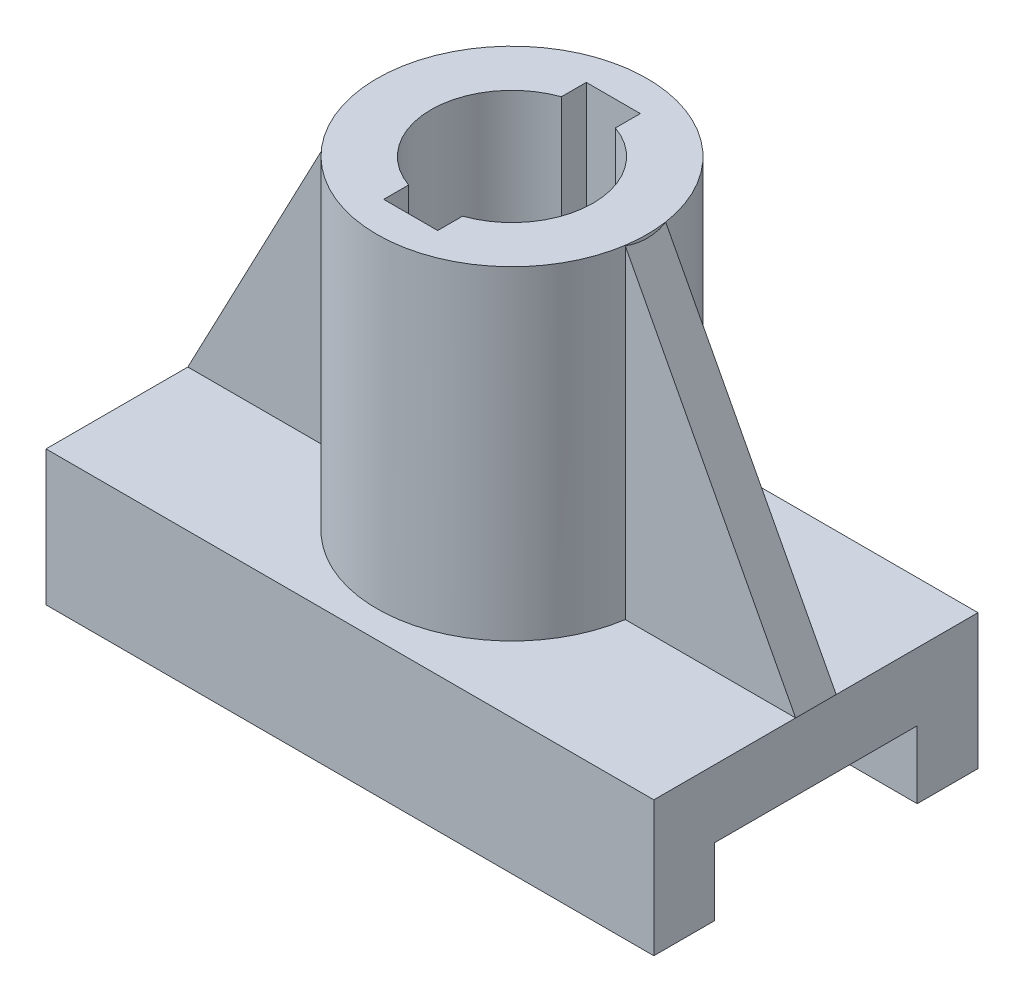
ISO-10303-21;
HEADER;
FILE_DESCRIPTION(('STEP AP214'),'2;1');
FILE_NAME('part.step','',(''),(''),'','','');
FILE_SCHEMA(('AUTOMOTIVE_DESIGN { 1 0 10303 214 1 1 1 1 }'));
ENDSEC;
DATA;
#1=APPLICATION_CONTEXT('core data for automotive mechanical design processes');
#2=APPLICATION_PROTOCOL_DEFINITION('international standard','automotive_design',2000,#1);
#3=PRODUCT_CONTEXT('',#1,'mechanical');
#4=PRODUCT('Part','Part','',(#3));
#5=PRODUCT_RELATED_PRODUCT_CATEGORY('part','',(#4));
#6=PRODUCT_DEFINITION_FORMATION('','',#4);
#7=PRODUCT_DEFINITION_CONTEXT('part definition',#1,'design');
#8=PRODUCT_DEFINITION('design','',#6,#7);
#9=PRODUCT_DEFINITION_SHAPE('','',#8);
#10=(LENGTH_UNIT() NAMED_UNIT(*) SI_UNIT(.MILLI.,.METRE.));
#11=(NAMED_UNIT(*) PLANE_ANGLE_UNIT() SI_UNIT($,.RADIAN.));
#12=(NAMED_UNIT(*) SI_UNIT($,.STERADIAN.) SOLID_ANGLE_UNIT());
#13=UNCERTAINTY_MEASURE_WITH_UNIT(LENGTH_MEASURE(1.E-05),#10,'distance_accuracy_value','');
#14=(GEOMETRIC_REPRESENTATION_CONTEXT(3) GLOBAL_UNCERTAINTY_ASSIGNED_CONTEXT((#13)) GLOBAL_UNIT_ASSIGNED_CONTEXT((#10,
#11,#12)) REPRESENTATION_CONTEXT('',''));
#15=CARTESIAN_POINT('',(0.,0.,0.));
#16=DIRECTION('',(0.,0.,1.));
#17=DIRECTION('',(1.,0.,0.));
#18=AXIS2_PLACEMENT_3D('',#15,#16,#17);
#19=CARTESIAN_POINT('',(0.,20.,0.));
#20=DIRECTION('',(0.,1.,0.));
#21=DIRECTION('',(0.,0.,1.));
#22=AXIS2_PLACEMENT_3D('',#19,#20,#21);
#23=PLANE('',#22);
#24=DIRECTION('',(0.,0.,1.));
#25=VECTOR('',#24,1.);
#26=CARTESIAN_POINT('',(-45.,20.,-24.));
#27=LINE('',#26,#25);
#28=CARTESIAN_POINT('',(-45.,20.,-24.));
#29=VERTEX_POINT('',#28);
#30=CARTESIAN_POINT('',(-45.,20.,-3.));
#31=VERTEX_POINT('',#30);
#32=EDGE_CURVE('E202',#29,#31,#27,.T.);
#33=ORIENTED_EDGE('',*,*,#32,.T.);
#34=DIRECTION('',(-1.,0.,0.));
#35=VECTOR('',#34,1.);
#36=CARTESIAN_POINT('',(0.,20.,-3.));
#37=LINE('',#36,#35);
#38=CARTESIAN_POINT('',(-19.7737199332852,20.,-3.));
#39=VERTEX_POINT('',#38);
#40=EDGE_CURVE('E201',#39,#31,#37,.T.);
#41=ORIENTED_EDGE('',*,*,#40,.F.);
#42=CARTESIAN_POINT('',(0.,20.,0.));
#43=DIRECTION('',(0.,1.,0.));
#44=DIRECTION('',(0.,0.,1.));
#45=AXIS2_PLACEMENT_3D('',#42,#43,#44);
#46=CIRCLE('',#45,20.);
#47=CARTESIAN_POINT('',(19.7737199332852,20.,-3.));
#48=VERTEX_POINT('',#47);
#49=EDGE_CURVE('E186',#48,#39,#46,.T.);
#50=ORIENTED_EDGE('',*,*,#49,.F.);
#51=DIRECTION('',(1.,0.,0.));
#52=VECTOR('',#51,1.);
#53=CARTESIAN_POINT('',(0.,20.,-3.));
#54=LINE('',#53,#52);
#55=CARTESIAN_POINT('',(45.,20.,-3.));
#56=VERTEX_POINT('',#55);
#57=EDGE_CURVE('E224',#48,#56,#54,.T.);
#58=ORIENTED_EDGE('',*,*,#57,.T.);
#59=DIRECTION('',(0.,0.,-1.));
#60=VECTOR('',#59,1.);
#61=CARTESIAN_POINT('',(45.,20.,-24.));
#62=LINE('',#61,#60);
#63=CARTESIAN_POINT('',(45.,20.,-24.));
#64=VERTEX_POINT('',#63);
#65=EDGE_CURVE('E316',#56,#64,#62,.T.);
#66=ORIENTED_EDGE('',*,*,#65,.T.);
#67=DIRECTION('',(-1.,0.,0.));
#68=VECTOR('',#67,1.);
#69=CARTESIAN_POINT('',(-45.,20.,-24.));
#70=LINE('',#69,#68);
#71=EDGE_CURVE('E315',#64,#29,#70,.T.);
#72=ORIENTED_EDGE('',*,*,#71,.T.);
#73=EDGE_LOOP('',(#33,#41,#50,#58,#66,#72));
#74=FACE_BOUND('',#73,.T.);
#75=ADVANCED_FACE('F37',(#74),#23,.T.);
#76=CARTESIAN_POINT('',(45.,20.,-24.));
#77=DIRECTION('',(-1.,0.,0.));
#78=DIRECTION('',(0.,0.,1.));
#79=AXIS2_PLACEMENT_3D('',#76,#77,#78);
#80=PLANE('',#79);
#81=DIRECTION('',(0.,0.,-1.));
#82=VECTOR('',#81,1.);
#83=CARTESIAN_POINT('',(45.,10.,-15.));
#84=LINE('',#83,#82);
#85=CARTESIAN_POINT('',(45.,10.,15.));
#86=VERTEX_POINT('',#85);
#87=CARTESIAN_POINT('',(45.,10.,-15.));
#88=VERTEX_POINT('',#87);
#89=EDGE_CURVE('E245',#86,#88,#84,.T.);
#90=ORIENTED_EDGE('',*,*,#89,.T.);
#91=DIRECTION('',(0.,-1.,0.));
#92=VECTOR('',#91,1.);
#93=CARTESIAN_POINT('',(45.,0.,-15.));
#94=LINE('',#93,#92);
#95=CARTESIAN_POINT('',(45.,0.,-15.));
#96=VERTEX_POINT('',#95);
#97=EDGE_CURVE('E239',#88,#96,#94,.T.);
#98=ORIENTED_EDGE('',*,*,#97,.T.);
#99=DIRECTION('',(0.,0.,-1.));
#100=VECTOR('',#99,1.);
#101=CARTESIAN_POINT('',(45.,0.,-24.));
#102=LINE('',#101,#100);
#103=CARTESIAN_POINT('',(45.,0.,-24.));
#104=VERTEX_POINT('',#103);
#105=EDGE_CURVE('E310',#96,#104,#102,.T.);
#106=ORIENTED_EDGE('',*,*,#105,.T.);
#107=DIRECTION('',(0.,-1.,0.));
#108=VECTOR('',#107,1.);
#109=CARTESIAN_POINT('',(45.,20.,-24.));
#110=LINE('',#109,#108);
#111=EDGE_CURVE('E342',#64,#104,#110,.T.);
#112=ORIENTED_EDGE('',*,*,#111,.F.);
#113=ORIENTED_EDGE('',*,*,#65,.F.);
#114=DIRECTION('',(0.,0.,1.));
#115=VECTOR('',#114,1.);
#116=CARTESIAN_POINT('',(45.,20.,0.));
#117=LINE('',#116,#115);
#118=CARTESIAN_POINT('',(45.,20.,3.));
#119=VERTEX_POINT('',#118);
#120=EDGE_CURVE('E236',#119,#56,#117,.F.);
#121=ORIENTED_EDGE('',*,*,#120,.F.);
#122=CARTESIAN_POINT('',(45.,20.,24.));
#123=VERTEX_POINT('',#122);
#124=EDGE_CURVE('E312',#123,#119,#62,.T.);
#125=ORIENTED_EDGE('',*,*,#124,.F.);
#126=DIRECTION('',(0.,-1.,0.));
#127=VECTOR('',#126,1.);
#128=CARTESIAN_POINT('',(45.,20.,24.));
#129=LINE('',#128,#127);
#130=CARTESIAN_POINT('',(45.,0.,24.));
#131=VERTEX_POINT('',#130);
#132=EDGE_CURVE('E322',#123,#131,#129,.T.);
#133=ORIENTED_EDGE('',*,*,#132,.T.);
#134=CARTESIAN_POINT('',(45.,0.,15.));
#135=VERTEX_POINT('',#134);
#136=EDGE_CURVE('E323',#131,#135,#102,.T.);
#137=ORIENTED_EDGE('',*,*,#136,.T.);
#138=DIRECTION('',(0.,1.,0.));
#139=VECTOR('',#138,1.);
#140=CARTESIAN_POINT('',(45.,0.,15.));
#141=LINE('',#140,#139);
#142=EDGE_CURVE('E242',#135,#86,#141,.T.);
#143=ORIENTED_EDGE('',*,*,#142,.T.);
#144=EDGE_LOOP('',(#90,#98,#106,#112,#113,#121,#125,#133,#137,#143));
#145=FACE_BOUND('',#144,.T.);
#146=ADVANCED_FACE('F39',(#145),#80,.F.);
#147=CARTESIAN_POINT('',(-45.,20.,-24.));
#148=DIRECTION('',(1.,0.,0.));
#149=DIRECTION('',(0.,0.,-1.));
#150=AXIS2_PLACEMENT_3D('',#147,#148,#149);
#151=PLANE('',#150);
#152=DIRECTION('',(0.,-1.,0.));
#153=VECTOR('',#152,1.);
#154=CARTESIAN_POINT('',(-45.,20.,24.));
#155=LINE('',#154,#153);
#156=CARTESIAN_POINT('',(-45.,20.,24.));
#157=VERTEX_POINT('',#156);
#158=CARTESIAN_POINT('',(-45.,0.,24.));
#159=VERTEX_POINT('',#158);
#160=EDGE_CURVE('E336',#157,#159,#155,.T.);
#161=ORIENTED_EDGE('',*,*,#160,.F.);
#162=CARTESIAN_POINT('',(-45.,20.,3.));
#163=VERTEX_POINT('',#162);
#164=EDGE_CURVE('E318',#163,#157,#27,.T.);
#165=ORIENTED_EDGE('',*,*,#164,.F.);
#166=DIRECTION('',(0.,0.,1.));
#167=VECTOR('',#166,1.);
#168=CARTESIAN_POINT('',(-45.,20.,0.));
#169=LINE('',#168,#167);
#170=EDGE_CURVE('E59',#163,#31,#169,.F.);
#171=ORIENTED_EDGE('',*,*,#170,.T.);
#172=ORIENTED_EDGE('',*,*,#32,.F.);
#173=DIRECTION('',(0.,-1.,0.));
#174=VECTOR('',#173,1.);
#175=CARTESIAN_POINT('',(-45.,20.,-24.));
#176=LINE('',#175,#174);
#177=CARTESIAN_POINT('',(-45.,0.,-24.));
#178=VERTEX_POINT('',#177);
#179=EDGE_CURVE('E339',#29,#178,#176,.T.);
#180=ORIENTED_EDGE('',*,*,#179,.T.);
#181=DIRECTION('',(0.,0.,1.));
#182=VECTOR('',#181,1.);
#183=CARTESIAN_POINT('',(-45.,0.,-24.));
#184=LINE('',#183,#182);
#185=CARTESIAN_POINT('',(-45.,0.,-15.));
#186=VERTEX_POINT('',#185);
#187=EDGE_CURVE('E329',#178,#186,#184,.T.);
#188=ORIENTED_EDGE('',*,*,#187,.T.);
#189=DIRECTION('',(0.,-1.,0.));
#190=VECTOR('',#189,1.);
#191=CARTESIAN_POINT('',(-45.,20.,-15.));
#192=LINE('',#191,#190);
#193=CARTESIAN_POINT('',(-45.,10.,-15.));
#194=VERTEX_POINT('',#193);
#195=EDGE_CURVE('E254',#194,#186,#192,.T.);
#196=ORIENTED_EDGE('',*,*,#195,.F.);
#197=DIRECTION('',(0.,0.,-1.));
#198=VECTOR('',#197,1.);
#199=CARTESIAN_POINT('',(-45.,10.,-24.));
#200=LINE('',#199,#198);
#201=CARTESIAN_POINT('',(-45.,10.,15.));
#202=VERTEX_POINT('',#201);
#203=EDGE_CURVE('E11',#202,#194,#200,.T.);
#204=ORIENTED_EDGE('',*,*,#203,.F.);
#205=DIRECTION('',(0.,1.,0.));
#206=VECTOR('',#205,1.);
#207=CARTESIAN_POINT('',(-45.,20.,15.));
#208=LINE('',#207,#206);
#209=CARTESIAN_POINT('',(-45.,0.,15.));
#210=VERTEX_POINT('',#209);
#211=EDGE_CURVE('E252',#210,#202,#208,.T.);
#212=ORIENTED_EDGE('',*,*,#211,.F.);
#213=EDGE_CURVE('E328',#210,#159,#184,.T.);
#214=ORIENTED_EDGE('',*,*,#213,.T.);
#215=EDGE_LOOP('',(#161,#165,#171,#172,#180,#188,#196,#204,#212,#214));
#216=FACE_BOUND('',#215,.T.);
#217=ADVANCED_FACE('F392',(#216),#151,.F.);
#218=CARTESIAN_POINT('',(0.,0.,0.));
#219=DIRECTION('',(0.,1.,0.));
#220=DIRECTION('',(0.,0.,1.));
#221=AXIS2_PLACEMENT_3D('',#218,#219,#220);
#222=PLANE('',#221);
#223=DIRECTION('',(1.,0.,0.));
#224=VECTOR('',#223,1.);
#225=CARTESIAN_POINT('',(0.,0.,-15.));
#226=LINE('',#225,#224);
#227=EDGE_CURVE('E45',#186,#96,#226,.T.);
#228=ORIENTED_EDGE('',*,*,#227,.F.);
#229=ORIENTED_EDGE('',*,*,#187,.F.);
#230=DIRECTION('',(-1.,0.,0.));
#231=VECTOR('',#230,1.);
#232=CARTESIAN_POINT('',(-45.,0.,-24.));
#233=LINE('',#232,#231);
#234=EDGE_CURVE('E326',#104,#178,#233,.T.);
#235=ORIENTED_EDGE('',*,*,#234,.F.);
#236=ORIENTED_EDGE('',*,*,#105,.F.);
#237=EDGE_LOOP('',(#228,#229,#235,#236));
#238=FACE_BOUND('',#237,.T.);
#239=ADVANCED_FACE('F358',(#238),#222,.F.);
#240=DIRECTION('',(-1.,0.,0.));
#241=VECTOR('',#240,1.);
#242=CARTESIAN_POINT('',(0.,0.,15.));
#243=LINE('',#242,#241);
#244=EDGE_CURVE('E197',#135,#210,#243,.T.);
#245=ORIENTED_EDGE('',*,*,#244,.F.);
#246=ORIENTED_EDGE('',*,*,#136,.F.);
#247=DIRECTION('',(1.,0.,0.));
#248=VECTOR('',#247,1.);
#249=CARTESIAN_POINT('',(-45.,0.,24.));
#250=LINE('',#249,#248);
#251=EDGE_CURVE('E332',#159,#131,#250,.T.);
#252=ORIENTED_EDGE('',*,*,#251,.F.);
#253=ORIENTED_EDGE('',*,*,#213,.F.);
#254=EDGE_LOOP('',(#245,#246,#252,#253));
#255=FACE_BOUND('',#254,.T.);
#256=ADVANCED_FACE('F413',(#255),#222,.F.);
#257=CARTESIAN_POINT('',(0.,20.,0.));
#258=DIRECTION('',(0.,1.,0.));
#259=DIRECTION('',(0.,0.,1.));
#260=AXIS2_PLACEMENT_3D('',#257,#258,#259);
#261=CYLINDRICAL_SURFACE('',#260,12.);
#262=CARTESIAN_POINT('',(0.,68.,0.));
#263=DIRECTION('',(0.,1.,0.));
#264=DIRECTION('',(0.,0.,1.));
#265=AXIS2_PLACEMENT_3D('',#262,#263,#264);
#266=CIRCLE('',#265,12.);
#267=CARTESIAN_POINT('',(4.,68.,11.3137084989848));
#268=VERTEX_POINT('',#267);
#269=CARTESIAN_POINT('',(4.,68.,-11.3137084989848));
#270=VERTEX_POINT('',#269);
#271=EDGE_CURVE('E307',#268,#270,#266,.T.);
#272=ORIENTED_EDGE('',*,*,#271,.T.);
#273=DIRECTION('',(0.,1.,0.));
#274=VECTOR('',#273,1.);
#275=CARTESIAN_POINT('',(4.,20.,-11.3137084989848));
#276=LINE('',#275,#274);
#277=CARTESIAN_POINT('',(4.,20.,-11.3137084989848));
#278=VERTEX_POINT('',#277);
#279=EDGE_CURVE('E299',#270,#278,#276,.F.);
#280=ORIENTED_EDGE('',*,*,#279,.T.);
#281=CARTESIAN_POINT('',(0.,20.,0.));
#282=DIRECTION('',(0.,1.,0.));
#283=DIRECTION('',(0.,0.,1.));
#284=AXIS2_PLACEMENT_3D('',#281,#282,#283);
#285=CIRCLE('',#284,12.);
#286=CARTESIAN_POINT('',(4.,20.,11.3137084989848));
#287=VERTEX_POINT('',#286);
#288=EDGE_CURVE('E303',#287,#278,#285,.T.);
#289=ORIENTED_EDGE('',*,*,#288,.F.);
#290=DIRECTION('',(0.,1.,0.));
#291=VECTOR('',#290,1.);
#292=CARTESIAN_POINT('',(4.,20.,11.3137084989848));
#293=LINE('',#292,#291);
#294=EDGE_CURVE('E296',#287,#268,#293,.T.);
#295=ORIENTED_EDGE('',*,*,#294,.T.);
#296=EDGE_LOOP('',(#272,#280,#289,#295));
#297=FACE_BOUND('',#296,.T.);
#298=ADVANCED_FACE('F407',(#297),#261,.F.);
#299=CARTESIAN_POINT('',(-45.,20.,-24.));
#300=DIRECTION('',(0.,0.,1.));
#301=DIRECTION('',(1.,0.,0.));
#302=AXIS2_PLACEMENT_3D('',#299,#300,#301);
#303=PLANE('',#302);
#304=ORIENTED_EDGE('',*,*,#234,.T.);
#305=ORIENTED_EDGE('',*,*,#179,.F.);
#306=ORIENTED_EDGE('',*,*,#71,.F.);
#307=ORIENTED_EDGE('',*,*,#111,.T.);
#308=EDGE_LOOP('',(#304,#305,#306,#307));
#309=FACE_BOUND('',#308,.T.);
#310=ADVANCED_FACE('F362',(#309),#303,.F.);
#311=CARTESIAN_POINT('',(-45.,20.,24.));
#312=DIRECTION('',(0.,0.,-1.));
#313=DIRECTION('',(-1.,0.,0.));
#314=AXIS2_PLACEMENT_3D('',#311,#312,#313);
#315=PLANE('',#314);
#316=ORIENTED_EDGE('',*,*,#251,.T.);
#317=ORIENTED_EDGE('',*,*,#132,.F.);
#318=DIRECTION('',(1.,0.,0.));
#319=VECTOR('',#318,1.);
#320=CARTESIAN_POINT('',(-45.,20.,24.));
#321=LINE('',#320,#319);
#322=EDGE_CURVE('E320',#157,#123,#321,.T.);
#323=ORIENTED_EDGE('',*,*,#322,.F.);
#324=ORIENTED_EDGE('',*,*,#160,.T.);
#325=EDGE_LOOP('',(#316,#317,#323,#324));
#326=FACE_BOUND('',#325,.T.);
#327=ADVANCED_FACE('F396',(#326),#315,.F.);
#328=DIRECTION('',(-1.,0.,0.));
#329=VECTOR('',#328,1.);
#330=CARTESIAN_POINT('',(0.,20.,3.));
#331=LINE('',#330,#329);
#332=CARTESIAN_POINT('',(-19.7737199332852,20.,3.));
#333=VERTEX_POINT('',#332);
#334=EDGE_CURVE('E52',#333,#163,#331,.T.);
#335=ORIENTED_EDGE('',*,*,#334,.T.);
#336=ORIENTED_EDGE('',*,*,#164,.T.);
#337=ORIENTED_EDGE('',*,*,#322,.T.);
#338=ORIENTED_EDGE('',*,*,#124,.T.);
#339=DIRECTION('',(1.,0.,0.));
#340=VECTOR('',#339,1.);
#341=CARTESIAN_POINT('',(0.,20.,3.));
#342=LINE('',#341,#340);
#343=CARTESIAN_POINT('',(19.7737199332852,20.,3.));
#344=VERTEX_POINT('',#343);
#345=EDGE_CURVE('E229',#344,#119,#342,.T.);
#346=ORIENTED_EDGE('',*,*,#345,.F.);
#347=EDGE_CURVE('E198',#333,#344,#46,.T.);
#348=ORIENTED_EDGE('',*,*,#347,.F.);
#349=EDGE_LOOP('',(#335,#336,#337,#338,#346,#348));
#350=FACE_BOUND('',#349,.T.);
#351=ADVANCED_FACE('F388',(#350),#23,.T.);
#352=CARTESIAN_POINT('',(0.,68.,0.));
#353=DIRECTION('',(0.,-1.,0.));
#354=DIRECTION('',(0.,0.,-1.));
#355=AXIS2_PLACEMENT_3D('',#352,#353,#354);
#356=CYLINDRICAL_SURFACE('',#355,20.);
#357=CARTESIAN_POINT('',(0.,105.5,0.));
#358=DIRECTION('',(-0.884918222381983,0.465746432832622,0.));
#359=DIRECTION('',(-0.465746432832622,-0.884918222381983,0.));
#360=AXIS2_PLACEMENT_3D('',#357,#358,#359);
#361=ELLIPSE('',#360,42.9418211071678,20.);
#362=CARTESIAN_POINT('',(-19.7737199332852,67.9299321267581,3.));
#363=VERTEX_POINT('',#362);
#364=CARTESIAN_POINT('',(-19.7737199332852,67.9299321267581,-3.));
#365=VERTEX_POINT('',#364);
#366=EDGE_CURVE('E217',#363,#365,#361,.F.);
#367=ORIENTED_EDGE('',*,*,#366,.F.);
#368=DIRECTION('',(0.,-1.,0.));
#369=VECTOR('',#368,1.);
#370=CARTESIAN_POINT('',(-19.7737199332852,68.,3.));
#371=LINE('',#370,#369);
#372=EDGE_CURVE('E211',#333,#363,#371,.F.);
#373=ORIENTED_EDGE('',*,*,#372,.F.);
#374=ORIENTED_EDGE('',*,*,#347,.T.);
#375=DIRECTION('',(0.,-1.,0.));
#376=VECTOR('',#375,1.);
#377=CARTESIAN_POINT('',(19.7737199332852,68.,3.));
#378=LINE('',#377,#376);
#379=CARTESIAN_POINT('',(19.7737199332852,67.9299321267581,3.));
#380=VERTEX_POINT('',#379);
#381=EDGE_CURVE('E232',#344,#380,#378,.F.);
#382=ORIENTED_EDGE('',*,*,#381,.T.);
#383=CARTESIAN_POINT('',(0.,105.5,0.));
#384=DIRECTION('',(-0.884918222381983,-0.465746432832622,0.));
#385=DIRECTION('',(0.465746432832622,-0.884918222381983,0.));
#386=AXIS2_PLACEMENT_3D('',#383,#384,#385);
#387=ELLIPSE('',#386,42.9418211071678,20.);
#388=CARTESIAN_POINT('',(19.7737199332852,67.9299321267581,-3.));
#389=VERTEX_POINT('',#388);
#390=EDGE_CURVE('E234',#380,#389,#387,.F.);
#391=ORIENTED_EDGE('',*,*,#390,.T.);
#392=DIRECTION('',(0.,-1.,0.));
#393=VECTOR('',#392,1.);
#394=CARTESIAN_POINT('',(19.7737199332852,68.,-3.));
#395=LINE('',#394,#393);
#396=EDGE_CURVE('E194',#48,#389,#395,.F.);
#397=ORIENTED_EDGE('',*,*,#396,.F.);
#398=ORIENTED_EDGE('',*,*,#49,.T.);
#399=DIRECTION('',(0.,-1.,0.));
#400=VECTOR('',#399,1.);
#401=CARTESIAN_POINT('',(-19.7737199332852,68.,-3.));
#402=LINE('',#401,#400);
#403=EDGE_CURVE('E191',#39,#365,#402,.F.);
#404=ORIENTED_EDGE('',*,*,#403,.T.);
#405=EDGE_LOOP('',(#367,#373,#374,#382,#391,#397,#398,#404));
#406=FACE_BOUND('',#405,.T.);
#407=CARTESIAN_POINT('',(0.,68.,0.));
#408=DIRECTION('',(0.,1.,0.));
#409=DIRECTION('',(0.,0.,1.));
#410=AXIS2_PLACEMENT_3D('',#407,#408,#409);
#411=CIRCLE('',#410,20.);
#412=CARTESIAN_POINT('',(0.,68.,20.));
#413=VERTEX_POINT('',#412);
#414=EDGE_CURVE('E305',#413,#413,#411,.T.);
#415=ORIENTED_EDGE('',*,*,#414,.F.);
#416=EDGE_LOOP('',(#415));
#417=FACE_BOUND('',#416,.T.);
#418=ADVANCED_FACE('F188',(#406,#417),#356,.T.);
#419=CARTESIAN_POINT('',(0.,68.,0.));
#420=DIRECTION('',(0.,1.,0.));
#421=DIRECTION('',(0.,0.,1.));
#422=AXIS2_PLACEMENT_3D('',#419,#420,#421);
#423=PLANE('',#422);
#424=DIRECTION('',(0.,0.,1.));
#425=VECTOR('',#424,1.);
#426=CARTESIAN_POINT('',(-4.,68.,15.));
#427=LINE('',#426,#425);
#428=CARTESIAN_POINT('',(-4.,68.,11.3137084989848));
#429=VERTEX_POINT('',#428);
#430=CARTESIAN_POINT('',(-4.,68.,15.));
#431=VERTEX_POINT('',#430);
#432=EDGE_CURVE('E275',#429,#431,#427,.T.);
#433=ORIENTED_EDGE('',*,*,#432,.F.);
#434=CARTESIAN_POINT('',(-4.,68.,-11.3137084989848));
#435=VERTEX_POINT('',#434);
#436=EDGE_CURVE('E302',#435,#429,#266,.T.);
#437=ORIENTED_EDGE('',*,*,#436,.F.);
#438=CARTESIAN_POINT('',(-4.,68.,-15.));
#439=VERTEX_POINT('',#438);
#440=EDGE_CURVE('E276',#439,#435,#427,.T.);
#441=ORIENTED_EDGE('',*,*,#440,.F.);
#442=DIRECTION('',(-1.,0.,0.));
#443=VECTOR('',#442,1.);
#444=CARTESIAN_POINT('',(-4.,68.,-15.));
#445=LINE('',#444,#443);
#446=CARTESIAN_POINT('',(4.,68.,-15.));
#447=VERTEX_POINT('',#446);
#448=EDGE_CURVE('E272',#447,#439,#445,.T.);
#449=ORIENTED_EDGE('',*,*,#448,.F.);
#450=DIRECTION('',(0.,0.,-1.));
#451=VECTOR('',#450,1.);
#452=CARTESIAN_POINT('',(4.,68.,15.));
#453=LINE('',#452,#451);
#454=EDGE_CURVE('E256',#270,#447,#453,.T.);
#455=ORIENTED_EDGE('',*,*,#454,.F.);
#456=ORIENTED_EDGE('',*,*,#271,.F.);
#457=CARTESIAN_POINT('',(4.,68.,15.));
#458=VERTEX_POINT('',#457);
#459=EDGE_CURVE('E270',#458,#268,#453,.T.);
#460=ORIENTED_EDGE('',*,*,#459,.F.);
#461=DIRECTION('',(1.,0.,0.));
#462=VECTOR('',#461,1.);
#463=CARTESIAN_POINT('',(-4.,68.,15.));
#464=LINE('',#463,#462);
#465=EDGE_CURVE('E278',#431,#458,#464,.T.);
#466=ORIENTED_EDGE('',*,*,#465,.F.);
#467=EDGE_LOOP('',(#433,#437,#441,#449,#455,#456,#460,#466));
#468=FACE_BOUND('',#467,.T.);
#469=ORIENTED_EDGE('',*,*,#414,.T.);
#470=EDGE_LOOP('',(#469));
#471=FACE_BOUND('',#470,.T.);
#472=ADVANCED_FACE('F401',(#468,#471),#423,.T.);
#473=DIRECTION('',(0.,1.,0.));
#474=VECTOR('',#473,1.);
#475=CARTESIAN_POINT('',(-4.,20.,11.3137084989848));
#476=LINE('',#475,#474);
#477=CARTESIAN_POINT('',(-4.,20.,11.3137084989848));
#478=VERTEX_POINT('',#477);
#479=EDGE_CURVE('E293',#429,#478,#476,.F.);
#480=ORIENTED_EDGE('',*,*,#479,.T.);
#481=CARTESIAN_POINT('',(-4.,20.,-11.3137084989848));
#482=VERTEX_POINT('',#481);
#483=EDGE_CURVE('E306',#482,#478,#285,.T.);
#484=ORIENTED_EDGE('',*,*,#483,.F.);
#485=DIRECTION('',(0.,1.,0.));
#486=VECTOR('',#485,1.);
#487=CARTESIAN_POINT('',(-4.,20.,-11.3137084989848));
#488=LINE('',#487,#486);
#489=EDGE_CURVE('E283',#482,#435,#488,.T.);
#490=ORIENTED_EDGE('',*,*,#489,.T.);
#491=ORIENTED_EDGE('',*,*,#436,.T.);
#492=EDGE_LOOP('',(#480,#484,#490,#491));
#493=FACE_BOUND('',#492,.T.);
#494=ADVANCED_FACE('F551',(#493),#261,.F.);
#495=CARTESIAN_POINT('',(0.,20.,0.));
#496=DIRECTION('',(0.,1.,0.));
#497=DIRECTION('',(0.,0.,1.));
#498=AXIS2_PLACEMENT_3D('',#495,#496,#497);
#499=PLANE('',#498);
#500=ORIENTED_EDGE('',*,*,#288,.T.);
#501=DIRECTION('',(0.,0.,-1.));
#502=VECTOR('',#501,1.);
#503=CARTESIAN_POINT('',(4.,20.,15.));
#504=LINE('',#503,#502);
#505=CARTESIAN_POINT('',(4.,20.,-15.));
#506=VERTEX_POINT('',#505);
#507=EDGE_CURVE('E260',#278,#506,#504,.T.);
#508=ORIENTED_EDGE('',*,*,#507,.T.);
#509=DIRECTION('',(-1.,0.,0.));
#510=VECTOR('',#509,1.);
#511=CARTESIAN_POINT('',(-4.,20.,-15.));
#512=LINE('',#511,#510);
#513=CARTESIAN_POINT('',(-4.,20.,-15.));
#514=VERTEX_POINT('',#513);
#515=EDGE_CURVE('E259',#506,#514,#512,.T.);
#516=ORIENTED_EDGE('',*,*,#515,.T.);
#517=DIRECTION('',(0.,0.,1.));
#518=VECTOR('',#517,1.);
#519=CARTESIAN_POINT('',(-4.,20.,15.));
#520=LINE('',#519,#518);
#521=EDGE_CURVE('E264',#514,#482,#520,.T.);
#522=ORIENTED_EDGE('',*,*,#521,.T.);
#523=ORIENTED_EDGE('',*,*,#483,.T.);
#524=CARTESIAN_POINT('',(-4.,20.,15.));
#525=VERTEX_POINT('',#524);
#526=EDGE_CURVE('E263',#478,#525,#520,.T.);
#527=ORIENTED_EDGE('',*,*,#526,.T.);
#528=DIRECTION('',(1.,0.,0.));
#529=VECTOR('',#528,1.);
#530=CARTESIAN_POINT('',(-4.,20.,15.));
#531=LINE('',#530,#529);
#532=CARTESIAN_POINT('',(4.,20.,15.));
#533=VERTEX_POINT('',#532);
#534=EDGE_CURVE('E266',#525,#533,#531,.T.);
#535=ORIENTED_EDGE('',*,*,#534,.T.);
#536=EDGE_CURVE('E257',#533,#287,#504,.T.);
#537=ORIENTED_EDGE('',*,*,#536,.T.);
#538=EDGE_LOOP('',(#500,#508,#516,#522,#523,#527,#535,#537));
#539=FACE_BOUND('',#538,.T.);
#540=ADVANCED_FACE('F511',(#539),#499,.T.);
#541=CARTESIAN_POINT('',(-4.,20.,15.));
#542=DIRECTION('',(-1.,0.,0.));
#543=DIRECTION('',(0.,0.,1.));
#544=AXIS2_PLACEMENT_3D('',#541,#542,#543);
#545=PLANE('',#544);
#546=ORIENTED_EDGE('',*,*,#521,.F.);
#547=DIRECTION('',(0.,1.,0.));
#548=VECTOR('',#547,1.);
#549=CARTESIAN_POINT('',(-4.,20.,-15.));
#550=LINE('',#549,#548);
#551=EDGE_CURVE('E287',#514,#439,#550,.T.);
#552=ORIENTED_EDGE('',*,*,#551,.T.);
#553=ORIENTED_EDGE('',*,*,#440,.T.);
#554=ORIENTED_EDGE('',*,*,#489,.F.);
#555=EDGE_LOOP('',(#546,#552,#553,#554));
#556=FACE_BOUND('',#555,.T.);
#557=ADVANCED_FACE('F506',(#556),#545,.F.);
#558=CARTESIAN_POINT('',(4.,20.,15.));
#559=DIRECTION('',(1.,0.,0.));
#560=DIRECTION('',(0.,0.,-1.));
#561=AXIS2_PLACEMENT_3D('',#558,#559,#560);
#562=PLANE('',#561);
#563=ORIENTED_EDGE('',*,*,#454,.T.);
#564=DIRECTION('',(0.,1.,0.));
#565=VECTOR('',#564,1.);
#566=CARTESIAN_POINT('',(4.,20.,-15.));
#567=LINE('',#566,#565);
#568=EDGE_CURVE('E269',#506,#447,#567,.T.);
#569=ORIENTED_EDGE('',*,*,#568,.F.);
#570=ORIENTED_EDGE('',*,*,#507,.F.);
#571=ORIENTED_EDGE('',*,*,#279,.F.);
#572=EDGE_LOOP('',(#563,#569,#570,#571));
#573=FACE_BOUND('',#572,.T.);
#574=ADVANCED_FACE('F510',(#573),#562,.F.);
#575=CARTESIAN_POINT('',(-4.,20.,-15.));
#576=DIRECTION('',(0.,0.,-1.));
#577=DIRECTION('',(-1.,0.,0.));
#578=AXIS2_PLACEMENT_3D('',#575,#576,#577);
#579=PLANE('',#578);
#580=ORIENTED_EDGE('',*,*,#448,.T.);
#581=ORIENTED_EDGE('',*,*,#551,.F.);
#582=ORIENTED_EDGE('',*,*,#515,.F.);
#583=ORIENTED_EDGE('',*,*,#568,.T.);
#584=EDGE_LOOP('',(#580,#581,#582,#583));
#585=FACE_BOUND('',#584,.T.);
#586=ADVANCED_FACE('F520',(#585),#579,.F.);
#587=ORIENTED_EDGE('',*,*,#536,.F.);
#588=DIRECTION('',(0.,1.,0.));
#589=VECTOR('',#588,1.);
#590=CARTESIAN_POINT('',(4.,20.,15.));
#591=LINE('',#590,#589);
#592=EDGE_CURVE('E281',#533,#458,#591,.T.);
#593=ORIENTED_EDGE('',*,*,#592,.T.);
#594=ORIENTED_EDGE('',*,*,#459,.T.);
#595=ORIENTED_EDGE('',*,*,#294,.F.);
#596=EDGE_LOOP('',(#587,#593,#594,#595));
#597=FACE_BOUND('',#596,.T.);
#598=ADVANCED_FACE('F523',(#597),#562,.F.);
#599=ORIENTED_EDGE('',*,*,#432,.T.);
#600=DIRECTION('',(0.,1.,0.));
#601=VECTOR('',#600,1.);
#602=CARTESIAN_POINT('',(-4.,20.,15.));
#603=LINE('',#602,#601);
#604=EDGE_CURVE('E284',#525,#431,#603,.T.);
#605=ORIENTED_EDGE('',*,*,#604,.F.);
#606=ORIENTED_EDGE('',*,*,#526,.F.);
#607=ORIENTED_EDGE('',*,*,#479,.F.);
#608=EDGE_LOOP('',(#599,#605,#606,#607));
#609=FACE_BOUND('',#608,.T.);
#610=ADVANCED_FACE('F500',(#609),#545,.F.);
#611=CARTESIAN_POINT('',(-4.,20.,15.));
#612=DIRECTION('',(0.,0.,1.));
#613=DIRECTION('',(1.,0.,0.));
#614=AXIS2_PLACEMENT_3D('',#611,#612,#613);
#615=PLANE('',#614);
#616=ORIENTED_EDGE('',*,*,#465,.T.);
#617=ORIENTED_EDGE('',*,*,#592,.F.);
#618=ORIENTED_EDGE('',*,*,#534,.F.);
#619=ORIENTED_EDGE('',*,*,#604,.T.);
#620=EDGE_LOOP('',(#616,#617,#618,#619));
#621=FACE_BOUND('',#620,.T.);
#622=ADVANCED_FACE('F475',(#621),#615,.F.);
#623=CARTESIAN_POINT('',(-45.000012,10.,-15.));
#624=DIRECTION('',(0.,-1.,0.));
#625=DIRECTION('',(0.,0.,-1.));
#626=AXIS2_PLACEMENT_3D('',#623,#624,#625);
#627=PLANE('',#626);
#628=ORIENTED_EDGE('',*,*,#203,.T.);
#629=DIRECTION('',(1.,0.,0.));
#630=VECTOR('',#629,1.);
#631=CARTESIAN_POINT('',(-45.000012,10.,-15.));
#632=LINE('',#631,#630);
#633=EDGE_CURVE('E247',#194,#88,#632,.T.);
#634=ORIENTED_EDGE('',*,*,#633,.T.);
#635=ORIENTED_EDGE('',*,*,#89,.F.);
#636=DIRECTION('',(1.,0.,0.));
#637=VECTOR('',#636,1.);
#638=CARTESIAN_POINT('',(-45.000012,10.,15.));
#639=LINE('',#638,#637);
#640=EDGE_CURVE('E250',#202,#86,#639,.T.);
#641=ORIENTED_EDGE('',*,*,#640,.F.);
#642=EDGE_LOOP('',(#628,#634,#635,#641));
#643=FACE_BOUND('',#642,.T.);
#644=ADVANCED_FACE('F471',(#643),#627,.T.);
#645=CARTESIAN_POINT('',(-45.000012,0.,-15.));
#646=DIRECTION('',(0.,0.,1.));
#647=DIRECTION('',(1.,0.,0.));
#648=AXIS2_PLACEMENT_3D('',#645,#646,#647);
#649=PLANE('',#648);
#650=ORIENTED_EDGE('',*,*,#195,.T.);
#651=ORIENTED_EDGE('',*,*,#227,.T.);
#652=ORIENTED_EDGE('',*,*,#97,.F.);
#653=ORIENTED_EDGE('',*,*,#633,.F.);
#654=EDGE_LOOP('',(#650,#651,#652,#653));
#655=FACE_BOUND('',#654,.T.);
#656=ADVANCED_FACE('F348',(#655),#649,.T.);
#657=CARTESIAN_POINT('',(-45.000012,0.,15.));
#658=DIRECTION('',(0.,0.,-1.));
#659=DIRECTION('',(-1.,0.,0.));
#660=AXIS2_PLACEMENT_3D('',#657,#658,#659);
#661=PLANE('',#660);
#662=ORIENTED_EDGE('',*,*,#211,.T.);
#663=ORIENTED_EDGE('',*,*,#640,.T.);
#664=ORIENTED_EDGE('',*,*,#142,.F.);
#665=ORIENTED_EDGE('',*,*,#244,.T.);
#666=EDGE_LOOP('',(#662,#663,#664,#665));
#667=FACE_BOUND('',#666,.T.);
#668=ADVANCED_FACE('F481',(#667),#661,.T.);
#669=CARTESIAN_POINT('',(20.,67.5,0.));
#670=DIRECTION('',(-0.884918222381983,-0.465746432832622,0.));
#671=DIRECTION('',(0.465746432832622,-0.884918222381983,0.));
#672=AXIS2_PLACEMENT_3D('',#669,#670,#671);
#673=PLANE('',#672);
#674=DIRECTION('',(0.465746432832622,-0.884918222381983,0.));
#675=VECTOR('',#674,1.);
#676=CARTESIAN_POINT('',(20.,67.5,3.));
#677=LINE('',#676,#675);
#678=EDGE_CURVE('E221',#380,#119,#677,.T.);
#679=ORIENTED_EDGE('',*,*,#678,.T.);
#680=ORIENTED_EDGE('',*,*,#120,.T.);
#681=DIRECTION('',(0.465746432832622,-0.884918222381983,0.));
#682=VECTOR('',#681,1.);
#683=CARTESIAN_POINT('',(20.,67.5,-3.));
#684=LINE('',#683,#682);
#685=EDGE_CURVE('E220',#389,#56,#684,.T.);
#686=ORIENTED_EDGE('',*,*,#685,.F.);
#687=ORIENTED_EDGE('',*,*,#390,.F.);
#688=EDGE_LOOP('',(#679,#680,#686,#687));
#689=FACE_BOUND('',#688,.T.);
#690=ADVANCED_FACE('F367',(#689),#673,.F.);
#691=CARTESIAN_POINT('',(0.,34.,3.));
#692=DIRECTION('',(0.,0.,1.));
#693=DIRECTION('',(1.,0.,0.));
#694=AXIS2_PLACEMENT_3D('',#691,#692,#693);
#695=PLANE('',#694);
#696=ORIENTED_EDGE('',*,*,#381,.F.);
#697=ORIENTED_EDGE('',*,*,#345,.T.);
#698=ORIENTED_EDGE('',*,*,#678,.F.);
#699=EDGE_LOOP('',(#696,#697,#698));
#700=FACE_BOUND('',#699,.T.);
#701=ADVANCED_FACE('F374',(#700),#695,.T.);
#702=CARTESIAN_POINT('',(0.,34.,-3.));
#703=DIRECTION('',(0.,0.,1.));
#704=DIRECTION('',(1.,0.,0.));
#705=AXIS2_PLACEMENT_3D('',#702,#703,#704);
#706=PLANE('',#705);
#707=ORIENTED_EDGE('',*,*,#57,.F.);
#708=ORIENTED_EDGE('',*,*,#396,.T.);
#709=ORIENTED_EDGE('',*,*,#685,.T.);
#710=EDGE_LOOP('',(#707,#708,#709));
#711=FACE_BOUND('',#710,.T.);
#712=ADVANCED_FACE('F371',(#711),#706,.F.);
#713=CARTESIAN_POINT('',(-20.,67.5,0.));
#714=DIRECTION('',(0.884918222381983,-0.465746432832622,0.));
#715=DIRECTION('',(-0.465746432832622,-0.884918222381983,0.));
#716=AXIS2_PLACEMENT_3D('',#713,#714,#715);
#717=PLANE('',#716);
#718=DIRECTION('',(-0.465746432832622,-0.884918222381983,0.));
#719=VECTOR('',#718,1.);
#720=CARTESIAN_POINT('',(-20.,67.5,3.));
#721=LINE('',#720,#719);
#722=EDGE_CURVE('E205',#363,#163,#721,.T.);
#723=ORIENTED_EDGE('',*,*,#722,.F.);
#724=ORIENTED_EDGE('',*,*,#366,.T.);
#725=DIRECTION('',(-0.465746432832622,-0.884918222381983,0.));
#726=VECTOR('',#725,1.);
#727=CARTESIAN_POINT('',(-20.,67.5,-3.));
#728=LINE('',#727,#726);
#729=EDGE_CURVE('E208',#365,#31,#728,.T.);
#730=ORIENTED_EDGE('',*,*,#729,.T.);
#731=ORIENTED_EDGE('',*,*,#170,.F.);
#732=EDGE_LOOP('',(#723,#724,#730,#731));
#733=FACE_BOUND('',#732,.T.);
#734=ADVANCED_FACE('F373',(#733),#717,.F.);
#735=CARTESIAN_POINT('',(0.,34.,3.));
#736=DIRECTION('',(0.,0.,1.));
#737=DIRECTION('',(-1.,0.,0.));
#738=AXIS2_PLACEMENT_3D('',#735,#736,#737);
#739=PLANE('',#738);
#740=ORIENTED_EDGE('',*,*,#372,.T.);
#741=ORIENTED_EDGE('',*,*,#722,.T.);
#742=ORIENTED_EDGE('',*,*,#334,.F.);
#743=EDGE_LOOP('',(#740,#741,#742));
#744=FACE_BOUND('',#743,.T.);
#745=ADVANCED_FACE('F380',(#744),#739,.T.);
#746=CARTESIAN_POINT('',(0.,34.,-3.));
#747=DIRECTION('',(0.,0.,1.));
#748=DIRECTION('',(-1.,0.,0.));
#749=AXIS2_PLACEMENT_3D('',#746,#747,#748);
#750=PLANE('',#749);
#751=ORIENTED_EDGE('',*,*,#40,.T.);
#752=ORIENTED_EDGE('',*,*,#729,.F.);
#753=ORIENTED_EDGE('',*,*,#403,.F.);
#754=EDGE_LOOP('',(#751,#752,#753));
#755=FACE_BOUND('',#754,.T.);
#756=ADVANCED_FACE('F207',(#755),#750,.F.);
#757=CLOSED_SHELL('',(#75,#146,#217,#239,#256,#298,#310,#327,#351,#418,#472,#494,#540,#557,#574,
#586,#598,#610,#622,#644,#656,#668,#690,#701,#712,#734,#745,#756));
#758=MANIFOLD_SOLID_BREP('B2',#757);
#759=ADVANCED_BREP_SHAPE_REPRESENTATION('',(#18,#758),#14);
#760=SHAPE_DEFINITION_REPRESENTATION(#9,#759);
ENDSEC;
END-ISO-10303-21;
